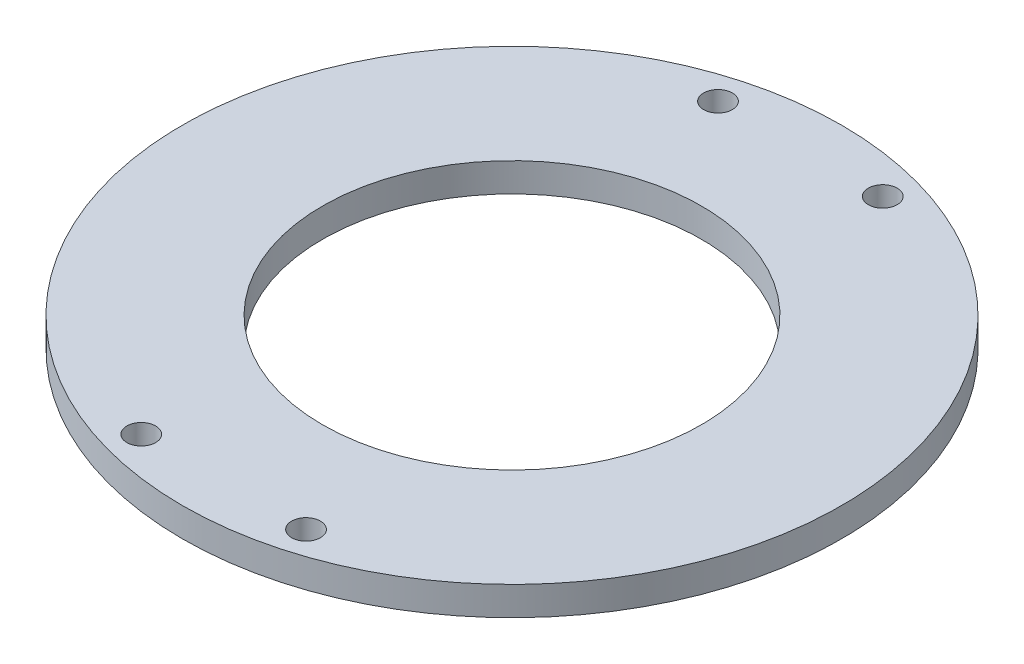
ISO-10303-21;
HEADER;
FILE_DESCRIPTION(('STEP AP214'),'2;1');
FILE_NAME('part.step','',(''),(''),'','','');
FILE_SCHEMA(('AUTOMOTIVE_DESIGN { 1 0 10303 214 1 1 1 1 }'));
ENDSEC;
DATA;
#1=APPLICATION_CONTEXT('core data for automotive mechanical design processes');
#2=APPLICATION_PROTOCOL_DEFINITION('international standard','automotive_design',2000,#1);
#3=PRODUCT_CONTEXT('',#1,'mechanical');
#4=PRODUCT('Part','Part','',(#3));
#5=PRODUCT_RELATED_PRODUCT_CATEGORY('part','',(#4));
#6=PRODUCT_DEFINITION_FORMATION('','',#4);
#7=PRODUCT_DEFINITION_CONTEXT('part definition',#1,'design');
#8=PRODUCT_DEFINITION('design','',#6,#7);
#9=PRODUCT_DEFINITION_SHAPE('','',#8);
#10=(LENGTH_UNIT() NAMED_UNIT(*) SI_UNIT(.MILLI.,.METRE.));
#11=(NAMED_UNIT(*) PLANE_ANGLE_UNIT() SI_UNIT($,.RADIAN.));
#12=(NAMED_UNIT(*) SI_UNIT($,.STERADIAN.) SOLID_ANGLE_UNIT());
#13=UNCERTAINTY_MEASURE_WITH_UNIT(LENGTH_MEASURE(1.E-05),#10,'distance_accuracy_value','');
#14=(GEOMETRIC_REPRESENTATION_CONTEXT(3) GLOBAL_UNCERTAINTY_ASSIGNED_CONTEXT((#13)) GLOBAL_UNIT_ASSIGNED_CONTEXT((#10,
#11,#12)) REPRESENTATION_CONTEXT('',''));
#15=CARTESIAN_POINT('',(0.,0.,0.));
#16=DIRECTION('',(0.,0.,1.));
#17=DIRECTION('',(1.,0.,0.));
#18=AXIS2_PLACEMENT_3D('',#15,#16,#17);
#19=CARTESIAN_POINT('',(0.,3.5,0.));
#20=DIRECTION('',(0.,1.,0.));
#21=DIRECTION('',(0.,0.,1.));
#22=AXIS2_PLACEMENT_3D('',#19,#20,#21);
#23=PLANE('',#22);
#24=CARTESIAN_POINT('',(-10.,3.5,35.));
#25=DIRECTION('',(0.,1.,0.));
#26=DIRECTION('',(0.,0.,1.));
#27=AXIS2_PLACEMENT_3D('',#24,#25,#26);
#28=CIRCLE('',#27,1.75);
#29=CARTESIAN_POINT('',(-10.,3.5,36.75));
#30=VERTEX_POINT('',#29);
#31=EDGE_CURVE('E67',#30,#30,#28,.T.);
#32=ORIENTED_EDGE('',*,*,#31,.F.);
#33=EDGE_LOOP('',(#32));
#34=FACE_BOUND('',#33,.T.);
#35=CARTESIAN_POINT('',(-10.,3.5,-35.));
#36=DIRECTION('',(0.,1.,0.));
#37=DIRECTION('',(0.,0.,1.));
#38=AXIS2_PLACEMENT_3D('',#35,#36,#37);
#39=CIRCLE('',#38,1.75);
#40=CARTESIAN_POINT('',(-10.,3.5,-33.25));
#41=VERTEX_POINT('',#40);
#42=EDGE_CURVE('E55',#41,#41,#39,.T.);
#43=ORIENTED_EDGE('',*,*,#42,.F.);
#44=EDGE_LOOP('',(#43));
#45=FACE_BOUND('',#44,.T.);
#46=CARTESIAN_POINT('',(0.,3.5,0.));
#47=DIRECTION('',(0.,1.,0.));
#48=DIRECTION('',(0.,0.,1.));
#49=AXIS2_PLACEMENT_3D('',#46,#47,#48);
#50=CIRCLE('',#49,40.);
#51=CARTESIAN_POINT('',(0.,3.5,40.));
#52=VERTEX_POINT('',#51);
#53=EDGE_CURVE('E10',#52,#52,#50,.T.);
#54=ORIENTED_EDGE('',*,*,#53,.T.);
#55=EDGE_LOOP('',(#54));
#56=FACE_BOUND('',#55,.T.);
#57=CARTESIAN_POINT('',(10.,3.5,-35.));
#58=DIRECTION('',(0.,1.,0.));
#59=DIRECTION('',(0.,0.,1.));
#60=AXIS2_PLACEMENT_3D('',#57,#58,#59);
#61=CIRCLE('',#60,1.75);
#62=CARTESIAN_POINT('',(10.,3.5,-33.25));
#63=VERTEX_POINT('',#62);
#64=EDGE_CURVE('E50',#63,#63,#61,.T.);
#65=ORIENTED_EDGE('',*,*,#64,.F.);
#66=EDGE_LOOP('',(#65));
#67=FACE_BOUND('',#66,.T.);
#68=CARTESIAN_POINT('',(10.,3.5,35.));
#69=DIRECTION('',(0.,1.,0.));
#70=DIRECTION('',(0.,0.,1.));
#71=AXIS2_PLACEMENT_3D('',#68,#69,#70);
#72=CIRCLE('',#71,1.75);
#73=CARTESIAN_POINT('',(10.,3.5,36.75));
#74=VERTEX_POINT('',#73);
#75=EDGE_CURVE('E61',#74,#74,#72,.T.);
#76=ORIENTED_EDGE('',*,*,#75,.F.);
#77=EDGE_LOOP('',(#76));
#78=FACE_BOUND('',#77,.T.);
#79=CARTESIAN_POINT('',(0.,3.5,0.));
#80=DIRECTION('',(0.,1.,0.));
#81=DIRECTION('',(0.,0.,1.));
#82=AXIS2_PLACEMENT_3D('',#79,#80,#81);
#83=CIRCLE('',#82,23.);
#84=CARTESIAN_POINT('',(0.,3.5,23.));
#85=VERTEX_POINT('',#84);
#86=EDGE_CURVE('E73',#85,#85,#83,.T.);
#87=ORIENTED_EDGE('',*,*,#86,.F.);
#88=EDGE_LOOP('',(#87));
#89=FACE_BOUND('',#88,.T.);
#90=ADVANCED_FACE('F39',(#34,#45,#56,#67,#78,#89),#23,.T.);
#91=CARTESIAN_POINT('',(0.,0.,0.));
#92=DIRECTION('',(0.,1.,0.));
#93=DIRECTION('',(0.,0.,1.));
#94=AXIS2_PLACEMENT_3D('',#91,#92,#93);
#95=PLANE('',#94);
#96=CARTESIAN_POINT('',(0.,0.,0.));
#97=DIRECTION('',(0.,1.,0.));
#98=DIRECTION('',(0.,0.,1.));
#99=AXIS2_PLACEMENT_3D('',#96,#97,#98);
#100=CIRCLE('',#99,40.);
#101=CARTESIAN_POINT('',(0.,0.,40.));
#102=VERTEX_POINT('',#101);
#103=EDGE_CURVE('E43',#102,#102,#100,.T.);
#104=ORIENTED_EDGE('',*,*,#103,.F.);
#105=EDGE_LOOP('',(#104));
#106=FACE_BOUND('',#105,.T.);
#107=CARTESIAN_POINT('',(10.,0.,-35.));
#108=DIRECTION('',(0.,1.,0.));
#109=DIRECTION('',(0.,0.,1.));
#110=AXIS2_PLACEMENT_3D('',#107,#108,#109);
#111=CIRCLE('',#110,1.75);
#112=CARTESIAN_POINT('',(10.,0.,-33.25));
#113=VERTEX_POINT('',#112);
#114=EDGE_CURVE('E52',#113,#113,#111,.T.);
#115=ORIENTED_EDGE('',*,*,#114,.T.);
#116=EDGE_LOOP('',(#115));
#117=FACE_BOUND('',#116,.T.);
#118=CARTESIAN_POINT('',(-10.,0.,-35.));
#119=DIRECTION('',(0.,1.,0.));
#120=DIRECTION('',(0.,0.,1.));
#121=AXIS2_PLACEMENT_3D('',#118,#119,#120);
#122=CIRCLE('',#121,1.75);
#123=CARTESIAN_POINT('',(-10.,0.,-33.25));
#124=VERTEX_POINT('',#123);
#125=EDGE_CURVE('E58',#124,#124,#122,.T.);
#126=ORIENTED_EDGE('',*,*,#125,.T.);
#127=EDGE_LOOP('',(#126));
#128=FACE_BOUND('',#127,.T.);
#129=CARTESIAN_POINT('',(10.,0.,35.));
#130=DIRECTION('',(0.,1.,0.));
#131=DIRECTION('',(0.,0.,1.));
#132=AXIS2_PLACEMENT_3D('',#129,#130,#131);
#133=CIRCLE('',#132,1.75);
#134=CARTESIAN_POINT('',(10.,0.,36.75));
#135=VERTEX_POINT('',#134);
#136=EDGE_CURVE('E64',#135,#135,#133,.T.);
#137=ORIENTED_EDGE('',*,*,#136,.T.);
#138=EDGE_LOOP('',(#137));
#139=FACE_BOUND('',#138,.T.);
#140=CARTESIAN_POINT('',(-10.,0.,35.));
#141=DIRECTION('',(0.,1.,0.));
#142=DIRECTION('',(0.,0.,1.));
#143=AXIS2_PLACEMENT_3D('',#140,#141,#142);
#144=CIRCLE('',#143,1.75);
#145=CARTESIAN_POINT('',(-10.,0.,36.75));
#146=VERTEX_POINT('',#145);
#147=EDGE_CURVE('E70',#146,#146,#144,.T.);
#148=ORIENTED_EDGE('',*,*,#147,.T.);
#149=EDGE_LOOP('',(#148));
#150=FACE_BOUND('',#149,.T.);
#151=CARTESIAN_POINT('',(0.,0.,0.));
#152=DIRECTION('',(0.,1.,0.));
#153=DIRECTION('',(0.,0.,1.));
#154=AXIS2_PLACEMENT_3D('',#151,#152,#153);
#155=CIRCLE('',#154,23.);
#156=CARTESIAN_POINT('',(0.,0.,23.));
#157=VERTEX_POINT('',#156);
#158=EDGE_CURVE('E76',#157,#157,#155,.T.);
#159=ORIENTED_EDGE('',*,*,#158,.T.);
#160=EDGE_LOOP('',(#159));
#161=FACE_BOUND('',#160,.T.);
#162=ADVANCED_FACE('F86',(#106,#117,#128,#139,#150,#161),#95,.F.);
#163=CARTESIAN_POINT('',(0.,3.5,0.));
#164=DIRECTION('',(0.,-1.,0.));
#165=DIRECTION('',(0.,0.,-1.));
#166=AXIS2_PLACEMENT_3D('',#163,#164,#165);
#167=CYLINDRICAL_SURFACE('',#166,40.);
#168=ORIENTED_EDGE('',*,*,#53,.F.);
#169=EDGE_LOOP('',(#168));
#170=FACE_BOUND('',#169,.T.);
#171=ORIENTED_EDGE('',*,*,#103,.T.);
#172=EDGE_LOOP('',(#171));
#173=FACE_BOUND('',#172,.T.);
#174=ADVANCED_FACE('F41',(#170,#173),#167,.T.);
#175=CARTESIAN_POINT('',(10.,3.5,-35.));
#176=DIRECTION('',(0.,-1.,0.));
#177=DIRECTION('',(0.,0.,-1.));
#178=AXIS2_PLACEMENT_3D('',#175,#176,#177);
#179=CYLINDRICAL_SURFACE('',#178,1.75);
#180=ORIENTED_EDGE('',*,*,#64,.T.);
#181=EDGE_LOOP('',(#180));
#182=FACE_BOUND('',#181,.T.);
#183=ORIENTED_EDGE('',*,*,#114,.F.);
#184=EDGE_LOOP('',(#183));
#185=FACE_BOUND('',#184,.T.);
#186=ADVANCED_FACE('F96',(#182,#185),#179,.F.);
#187=CARTESIAN_POINT('',(-10.,3.5,-35.));
#188=DIRECTION('',(0.,-1.,0.));
#189=DIRECTION('',(0.,0.,-1.));
#190=AXIS2_PLACEMENT_3D('',#187,#188,#189);
#191=CYLINDRICAL_SURFACE('',#190,1.75);
#192=ORIENTED_EDGE('',*,*,#42,.T.);
#193=EDGE_LOOP('',(#192));
#194=FACE_BOUND('',#193,.T.);
#195=ORIENTED_EDGE('',*,*,#125,.F.);
#196=EDGE_LOOP('',(#195));
#197=FACE_BOUND('',#196,.T.);
#198=ADVANCED_FACE('F99',(#194,#197),#191,.F.);
#199=CARTESIAN_POINT('',(10.,3.5,35.));
#200=DIRECTION('',(0.,-1.,0.));
#201=DIRECTION('',(0.,0.,-1.));
#202=AXIS2_PLACEMENT_3D('',#199,#200,#201);
#203=CYLINDRICAL_SURFACE('',#202,1.75);
#204=ORIENTED_EDGE('',*,*,#75,.T.);
#205=EDGE_LOOP('',(#204));
#206=FACE_BOUND('',#205,.T.);
#207=ORIENTED_EDGE('',*,*,#136,.F.);
#208=EDGE_LOOP('',(#207));
#209=FACE_BOUND('',#208,.T.);
#210=ADVANCED_FACE('F103',(#206,#209),#203,.F.);
#211=CARTESIAN_POINT('',(-10.,3.5,35.));
#212=DIRECTION('',(0.,-1.,0.));
#213=DIRECTION('',(0.,0.,-1.));
#214=AXIS2_PLACEMENT_3D('',#211,#212,#213);
#215=CYLINDRICAL_SURFACE('',#214,1.75);
#216=ORIENTED_EDGE('',*,*,#31,.T.);
#217=EDGE_LOOP('',(#216));
#218=FACE_BOUND('',#217,.T.);
#219=ORIENTED_EDGE('',*,*,#147,.F.);
#220=EDGE_LOOP('',(#219));
#221=FACE_BOUND('',#220,.T.);
#222=ADVANCED_FACE('F107',(#218,#221),#215,.F.);
#223=CARTESIAN_POINT('',(0.,3.5,0.));
#224=DIRECTION('',(0.,-1.,0.));
#225=DIRECTION('',(0.,0.,-1.));
#226=AXIS2_PLACEMENT_3D('',#223,#224,#225);
#227=CYLINDRICAL_SURFACE('',#226,23.);
#228=ORIENTED_EDGE('',*,*,#86,.T.);
#229=EDGE_LOOP('',(#228));
#230=FACE_BOUND('',#229,.T.);
#231=ORIENTED_EDGE('',*,*,#158,.F.);
#232=EDGE_LOOP('',(#231));
#233=FACE_BOUND('',#232,.T.);
#234=ADVANCED_FACE('F82',(#230,#233),#227,.F.);
#235=CLOSED_SHELL('',(#90,#162,#174,#186,#198,#210,#222,#234));
#236=MANIFOLD_SOLID_BREP('B2',#235);
#237=ADVANCED_BREP_SHAPE_REPRESENTATION('',(#18,#236),#14);
#238=SHAPE_DEFINITION_REPRESENTATION(#9,#237);
ENDSEC;
END-ISO-10303-21;
